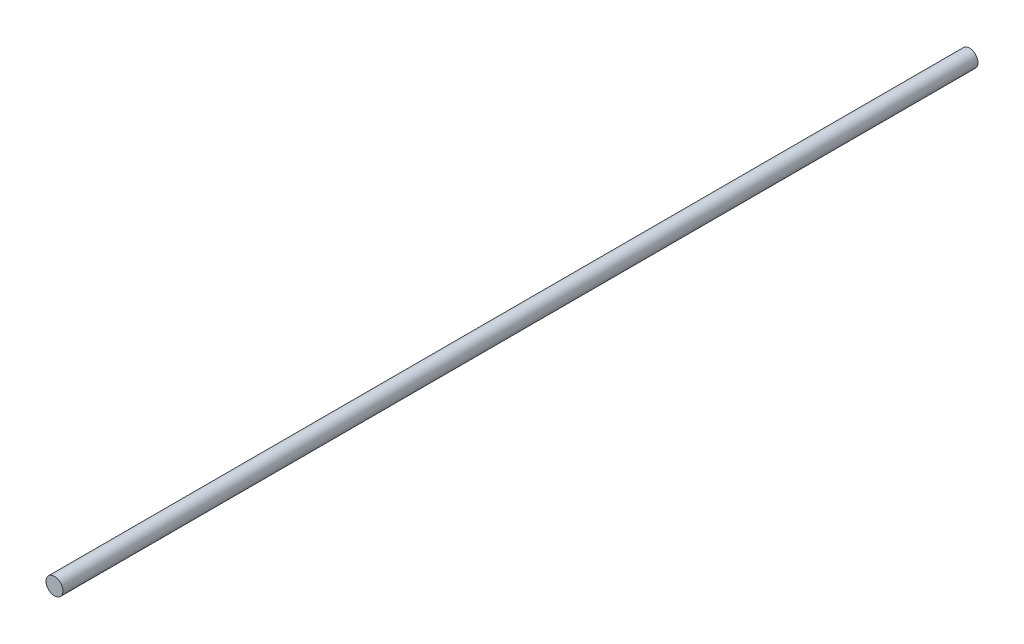
ISO-10303-21;
HEADER;
FILE_DESCRIPTION(('STEP AP214'),'2;1');
FILE_NAME('part.step','',(''),(''),'','','');
FILE_SCHEMA(('AUTOMOTIVE_DESIGN { 1 0 10303 214 1 1 1 1 }'));
ENDSEC;
DATA;
#1=APPLICATION_CONTEXT('core data for automotive mechanical design processes');
#2=APPLICATION_PROTOCOL_DEFINITION('international standard','automotive_design',2000,#1);
#3=PRODUCT_CONTEXT('',#1,'mechanical');
#4=PRODUCT('Part','Part','',(#3));
#5=PRODUCT_RELATED_PRODUCT_CATEGORY('part','',(#4));
#6=PRODUCT_DEFINITION_FORMATION('','',#4);
#7=PRODUCT_DEFINITION_CONTEXT('part definition',#1,'design');
#8=PRODUCT_DEFINITION('design','',#6,#7);
#9=PRODUCT_DEFINITION_SHAPE('','',#8);
#10=(LENGTH_UNIT() NAMED_UNIT(*) SI_UNIT(.MILLI.,.METRE.));
#11=(NAMED_UNIT(*) PLANE_ANGLE_UNIT() SI_UNIT($,.RADIAN.));
#12=(NAMED_UNIT(*) SI_UNIT($,.STERADIAN.) SOLID_ANGLE_UNIT());
#13=UNCERTAINTY_MEASURE_WITH_UNIT(LENGTH_MEASURE(1.E-05),#10,'distance_accuracy_value','');
#14=(GEOMETRIC_REPRESENTATION_CONTEXT(3) GLOBAL_UNCERTAINTY_ASSIGNED_CONTEXT((#13)) GLOBAL_UNIT_ASSIGNED_CONTEXT((#10,
#11,#12)) REPRESENTATION_CONTEXT('',''));
#15=CARTESIAN_POINT('',(0.,0.,0.));
#16=DIRECTION('',(0.,0.,1.));
#17=DIRECTION('',(1.,0.,0.));
#18=AXIS2_PLACEMENT_3D('',#15,#16,#17);
#19=CARTESIAN_POINT('',(0.,0.,540.));
#20=DIRECTION('',(0.,0.,-1.));
#21=DIRECTION('',(-1.,0.,0.));
#22=AXIS2_PLACEMENT_3D('',#19,#20,#21);
#23=CYLINDRICAL_SURFACE('',#22,5.);
#24=CARTESIAN_POINT('',(0.,0.,540.));
#25=DIRECTION('',(0.,0.,1.));
#26=DIRECTION('',(1.,0.,0.));
#27=AXIS2_PLACEMENT_3D('',#24,#25,#26);
#28=CIRCLE('',#27,5.);
#29=CARTESIAN_POINT('',(5.,0.,540.));
#30=VERTEX_POINT('',#29);
#31=EDGE_CURVE('E10',#30,#30,#28,.T.);
#32=ORIENTED_EDGE('',*,*,#31,.F.);
#33=EDGE_LOOP('',(#32));
#34=FACE_BOUND('',#33,.T.);
#35=CARTESIAN_POINT('',(0.,0.,0.));
#36=DIRECTION('',(0.,0.,1.));
#37=DIRECTION('',(1.,0.,0.));
#38=AXIS2_PLACEMENT_3D('',#35,#36,#37);
#39=CIRCLE('',#38,5.);
#40=CARTESIAN_POINT('',(5.,0.,0.));
#41=VERTEX_POINT('',#40);
#42=EDGE_CURVE('E42',#41,#41,#39,.T.);
#43=ORIENTED_EDGE('',*,*,#42,.T.);
#44=EDGE_LOOP('',(#43));
#45=FACE_BOUND('',#44,.T.);
#46=ADVANCED_FACE('F39',(#34,#45),#23,.T.);
#47=CARTESIAN_POINT('',(0.,0.,540.));
#48=DIRECTION('',(0.,0.,1.));
#49=DIRECTION('',(1.,0.,0.));
#50=AXIS2_PLACEMENT_3D('',#47,#48,#49);
#51=PLANE('',#50);
#52=ORIENTED_EDGE('',*,*,#31,.T.);
#53=EDGE_LOOP('',(#52));
#54=FACE_BOUND('',#53,.T.);
#55=ADVANCED_FACE('F56',(#54),#51,.T.);
#56=CARTESIAN_POINT('',(0.,0.,0.));
#57=DIRECTION('',(0.,0.,1.));
#58=DIRECTION('',(1.,0.,0.));
#59=AXIS2_PLACEMENT_3D('',#56,#57,#58);
#60=PLANE('',#59);
#61=ORIENTED_EDGE('',*,*,#42,.F.);
#62=EDGE_LOOP('',(#61));
#63=FACE_BOUND('',#62,.T.);
#64=ADVANCED_FACE('F54',(#63),#60,.F.);
#65=CLOSED_SHELL('',(#46,#55,#64));
#66=MANIFOLD_SOLID_BREP('B2',#65);
#67=ADVANCED_BREP_SHAPE_REPRESENTATION('',(#18,#66),#14);
#68=SHAPE_DEFINITION_REPRESENTATION(#9,#67);
ENDSEC;
END-ISO-10303-21;
